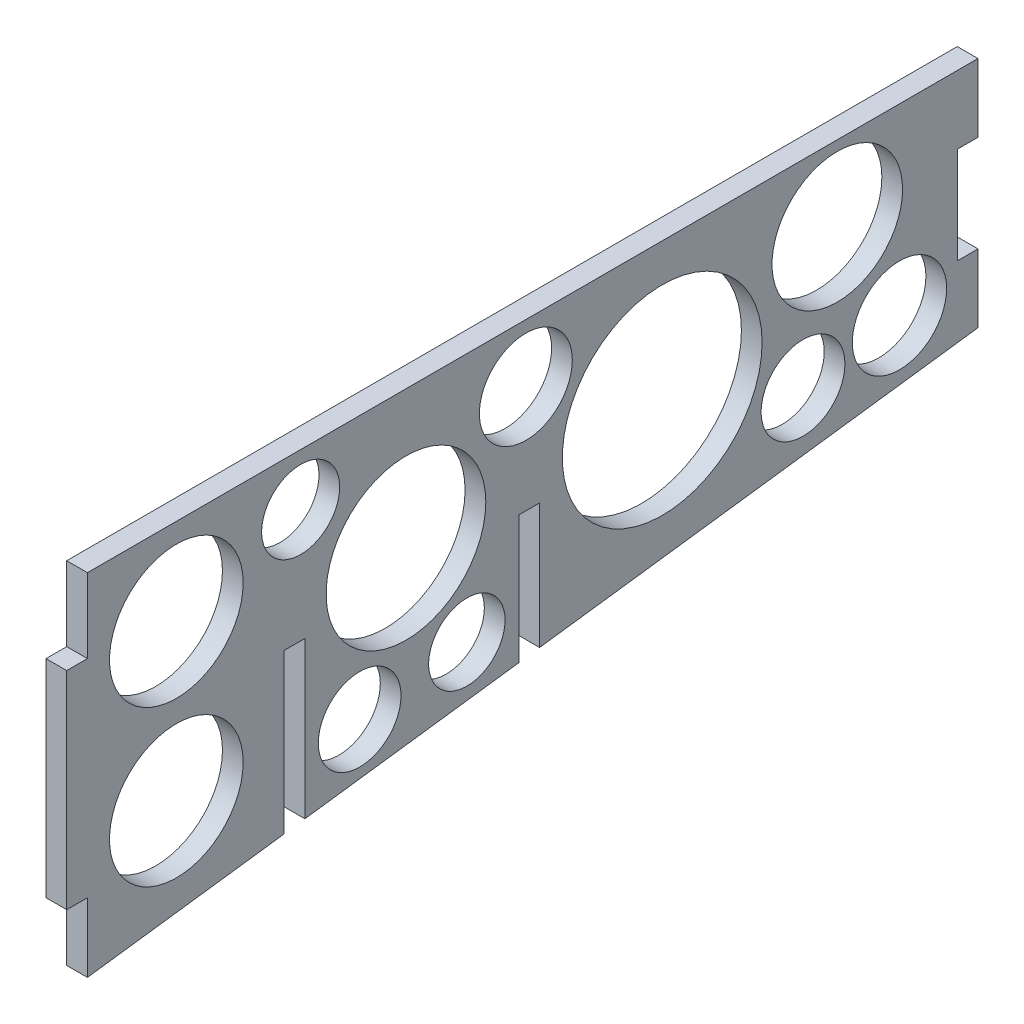
ISO-10303-21;
HEADER;
FILE_DESCRIPTION(('STEP AP214'),'2;1');
FILE_NAME('part.step','',(''),(''),'','','');
FILE_SCHEMA(('AUTOMOTIVE_DESIGN { 1 0 10303 214 1 1 1 1 }'));
ENDSEC;
DATA;
#1=APPLICATION_CONTEXT('core data for automotive mechanical design processes');
#2=APPLICATION_PROTOCOL_DEFINITION('international standard','automotive_design',2000,#1);
#3=PRODUCT_CONTEXT('',#1,'mechanical');
#4=PRODUCT('Part','Part','',(#3));
#5=PRODUCT_RELATED_PRODUCT_CATEGORY('part','',(#4));
#6=PRODUCT_DEFINITION_FORMATION('','',#4);
#7=PRODUCT_DEFINITION_CONTEXT('part definition',#1,'design');
#8=PRODUCT_DEFINITION('design','',#6,#7);
#9=PRODUCT_DEFINITION_SHAPE('','',#8);
#10=(LENGTH_UNIT() NAMED_UNIT(*) SI_UNIT(.MILLI.,.METRE.));
#11=(NAMED_UNIT(*) PLANE_ANGLE_UNIT() SI_UNIT($,.RADIAN.));
#12=(NAMED_UNIT(*) SI_UNIT($,.STERADIAN.) SOLID_ANGLE_UNIT());
#13=UNCERTAINTY_MEASURE_WITH_UNIT(LENGTH_MEASURE(1.E-05),#10,'distance_accuracy_value','');
#14=(GEOMETRIC_REPRESENTATION_CONTEXT(3) GLOBAL_UNCERTAINTY_ASSIGNED_CONTEXT((#13)) GLOBAL_UNIT_ASSIGNED_CONTEXT((#10,
#11,#12)) REPRESENTATION_CONTEXT('',''));
#15=CARTESIAN_POINT('',(0.,0.,0.));
#16=DIRECTION('',(0.,0.,1.));
#17=DIRECTION('',(1.,0.,0.));
#18=AXIS2_PLACEMENT_3D('',#15,#16,#17);
#19=CARTESIAN_POINT('',(3.,-33.7688746807964,-129.));
#20=DIRECTION('',(0.,0.,1.));
#21=DIRECTION('',(1.,0.,0.));
#22=AXIS2_PLACEMENT_3D('',#19,#20,#21);
#23=PLANE('',#22);
#24=DIRECTION('',(0.,1.,0.));
#25=VECTOR('',#24,1.);
#26=CARTESIAN_POINT('',(0.,-33.7688746807964,-129.));
#27=LINE('',#26,#25);
#28=CARTESIAN_POINT('',(0.,-33.7688746807964,-129.));
#29=VERTEX_POINT('',#28);
#30=CARTESIAN_POINT('',(0.,-23.8844373403982,-129.));
#31=VERTEX_POINT('',#30);
#32=EDGE_CURVE('E258',#29,#31,#27,.T.);
#33=ORIENTED_EDGE('',*,*,#32,.T.);
#34=DIRECTION('',(1.,0.,0.));
#35=VECTOR('',#34,1.);
#36=CARTESIAN_POINT('',(-7.,-23.8844373403982,-129.));
#37=LINE('',#36,#35);
#38=CARTESIAN_POINT('',(3.,-23.8844373403982,-129.));
#39=VERTEX_POINT('',#38);
#40=EDGE_CURVE('E299',#31,#39,#37,.T.);
#41=ORIENTED_EDGE('',*,*,#40,.T.);
#42=DIRECTION('',(0.,1.,0.));
#43=VECTOR('',#42,1.);
#44=CARTESIAN_POINT('',(3.,-33.7688746807964,-129.));
#45=LINE('',#44,#43);
#46=CARTESIAN_POINT('',(3.,-33.7688746807964,-129.));
#47=VERTEX_POINT('',#46);
#48=EDGE_CURVE('E234',#47,#39,#45,.T.);
#49=ORIENTED_EDGE('',*,*,#48,.F.);
#50=DIRECTION('',(-1.,0.,0.));
#51=VECTOR('',#50,1.);
#52=CARTESIAN_POINT('',(3.,-33.7688746807964,-129.));
#53=LINE('',#52,#51);
#54=EDGE_CURVE('E263',#47,#29,#53,.T.);
#55=ORIENTED_EDGE('',*,*,#54,.T.);
#56=EDGE_LOOP('',(#33,#41,#49,#55));
#57=FACE_BOUND('',#56,.T.);
#58=ADVANCED_FACE('F73',(#57),#23,.F.);
#59=CARTESIAN_POINT('',(3.,0.,0.));
#60=DIRECTION('',(0.,0.,-1.));
#61=DIRECTION('',(0.,1.,0.));
#62=AXIS2_PLACEMENT_3D('',#59,#60,#61);
#63=PLANE('',#62);
#64=DIRECTION('',(1.,0.,0.));
#65=VECTOR('',#64,1.);
#66=CARTESIAN_POINT('',(0.,-40.7776762914024,0.));
#67=LINE('',#66,#65);
#68=CARTESIAN_POINT('',(0.,-40.7776762914024,0.));
#69=VERTEX_POINT('',#68);
#70=CARTESIAN_POINT('',(3.,-40.7776762914024,0.));
#71=VERTEX_POINT('',#70);
#72=EDGE_CURVE('E388',#69,#71,#67,.T.);
#73=ORIENTED_EDGE('',*,*,#72,.F.);
#74=DIRECTION('',(0.,-1.,0.));
#75=VECTOR('',#74,1.);
#76=CARTESIAN_POINT('',(0.,0.,0.));
#77=LINE('',#76,#75);
#78=CARTESIAN_POINT('',(0.,-50.7776762914024,0.));
#79=VERTEX_POINT('',#78);
#80=EDGE_CURVE('E247',#69,#79,#77,.T.);
#81=ORIENTED_EDGE('',*,*,#80,.T.);
#82=DIRECTION('',(-1.,0.,0.));
#83=VECTOR('',#82,1.);
#84=CARTESIAN_POINT('',(3.,-50.7776762914024,0.));
#85=LINE('',#84,#83);
#86=CARTESIAN_POINT('',(3.,-50.7776762914024,0.));
#87=VERTEX_POINT('',#86);
#88=EDGE_CURVE('E266',#87,#79,#85,.T.);
#89=ORIENTED_EDGE('',*,*,#88,.F.);
#90=DIRECTION('',(0.,-1.,0.));
#91=VECTOR('',#90,1.);
#92=CARTESIAN_POINT('',(3.,0.,0.));
#93=LINE('',#92,#91);
#94=EDGE_CURVE('E430',#71,#87,#93,.T.);
#95=ORIENTED_EDGE('',*,*,#94,.F.);
#96=EDGE_LOOP('',(#73,#81,#89,#95));
#97=FACE_BOUND('',#96,.T.);
#98=ADVANCED_FACE('F440',(#97),#63,.F.);
#99=CARTESIAN_POINT('',(3.,-50.7776762914024,0.));
#100=DIRECTION('',(0.,0.991419352298649,0.130719806791963));
#101=DIRECTION('',(0.,-0.130719806791963,0.991419352298649));
#102=AXIS2_PLACEMENT_3D('',#99,#100,#101);
#103=PLANE('',#102);
#104=DIRECTION('',(0.,0.130719806791963,-0.991419352298649));
#105=VECTOR('',#104,1.);
#106=CARTESIAN_POINT('',(0.,-50.7776762914024,0.));
#107=LINE('',#106,#105);
#108=CARTESIAN_POINT('',(0.,-47.0199177960359,-28.5));
#109=VERTEX_POINT('',#108);
#110=EDGE_CURVE('E253',#79,#109,#107,.T.);
#111=ORIENTED_EDGE('',*,*,#110,.T.);
#112=DIRECTION('',(1.,0.,0.));
#113=VECTOR('',#112,1.);
#114=CARTESIAN_POINT('',(3.,-47.0199177960359,-28.5));
#115=LINE('',#114,#113);
#116=CARTESIAN_POINT('',(3.,-47.0199177960359,-28.5));
#117=VERTEX_POINT('',#116);
#118=EDGE_CURVE('E248',#109,#117,#115,.T.);
#119=ORIENTED_EDGE('',*,*,#118,.T.);
#120=DIRECTION('',(0.,0.130719806791963,-0.991419352298649));
#121=VECTOR('',#120,1.);
#122=CARTESIAN_POINT('',(3.,-50.7776762914024,0.));
#123=LINE('',#122,#121);
#124=EDGE_CURVE('E235',#87,#117,#123,.T.);
#125=ORIENTED_EDGE('',*,*,#124,.F.);
#126=ORIENTED_EDGE('',*,*,#88,.T.);
#127=EDGE_LOOP('',(#111,#119,#125,#126));
#128=FACE_BOUND('',#127,.T.);
#129=ADVANCED_FACE('F444',(#128),#103,.F.);
#130=CARTESIAN_POINT('',(3.,-46.6243642702079,-31.5));
#131=VERTEX_POINT('',#130);
#132=CARTESIAN_POINT('',(3.,-42.5369778366514,-62.5));
#133=VERTEX_POINT('',#132);
#134=EDGE_CURVE('E239',#131,#133,#123,.T.);
#135=ORIENTED_EDGE('',*,*,#134,.F.);
#136=DIRECTION('',(-1.,0.,0.));
#137=VECTOR('',#136,1.);
#138=CARTESIAN_POINT('',(3.,-46.6243642702079,-31.5));
#139=LINE('',#138,#137);
#140=CARTESIAN_POINT('',(0.,-46.6243642702079,-31.5));
#141=VERTEX_POINT('',#140);
#142=EDGE_CURVE('E425',#131,#141,#139,.T.);
#143=ORIENTED_EDGE('',*,*,#142,.T.);
#144=CARTESIAN_POINT('',(0.,-42.5369778366514,-62.5));
#145=VERTEX_POINT('',#144);
#146=EDGE_CURVE('E257',#141,#145,#107,.T.);
#147=ORIENTED_EDGE('',*,*,#146,.T.);
#148=DIRECTION('',(1.,0.,0.));
#149=VECTOR('',#148,1.);
#150=CARTESIAN_POINT('',(3.,-42.5369778366514,-62.5));
#151=LINE('',#150,#149);
#152=EDGE_CURVE('E422',#145,#133,#151,.T.);
#153=ORIENTED_EDGE('',*,*,#152,.T.);
#154=EDGE_LOOP('',(#135,#143,#147,#153));
#155=FACE_BOUND('',#154,.T.);
#156=ADVANCED_FACE('F459',(#155),#103,.F.);
#157=CARTESIAN_POINT('',(3.,0.,0.));
#158=DIRECTION('',(0.,-1.,0.));
#159=DIRECTION('',(0.,0.,-1.));
#160=AXIS2_PLACEMENT_3D('',#157,#158,#159);
#161=PLANE('',#160);
#162=DIRECTION('',(0.,0.,1.));
#163=VECTOR('',#162,1.);
#164=CARTESIAN_POINT('',(0.,0.,0.));
#165=LINE('',#164,#163);
#166=CARTESIAN_POINT('',(0.,0.,-129.));
#167=VERTEX_POINT('',#166);
#168=CARTESIAN_POINT('',(0.,0.,0.));
#169=VERTEX_POINT('',#168);
#170=EDGE_CURVE('E244',#167,#169,#165,.T.);
#171=ORIENTED_EDGE('',*,*,#170,.T.);
#172=DIRECTION('',(-1.,0.,0.));
#173=VECTOR('',#172,1.);
#174=CARTESIAN_POINT('',(3.,0.,0.));
#175=LINE('',#174,#173);
#176=CARTESIAN_POINT('',(3.,0.,0.));
#177=VERTEX_POINT('',#176);
#178=EDGE_CURVE('E269',#177,#169,#175,.T.);
#179=ORIENTED_EDGE('',*,*,#178,.F.);
#180=DIRECTION('',(0.,0.,1.));
#181=VECTOR('',#180,1.);
#182=CARTESIAN_POINT('',(3.,0.,0.));
#183=LINE('',#182,#181);
#184=CARTESIAN_POINT('',(3.,0.,-129.));
#185=VERTEX_POINT('',#184);
#186=EDGE_CURVE('E261',#185,#177,#183,.T.);
#187=ORIENTED_EDGE('',*,*,#186,.F.);
#188=DIRECTION('',(-1.,0.,0.));
#189=VECTOR('',#188,1.);
#190=CARTESIAN_POINT('',(3.,0.,-129.));
#191=LINE('',#190,#189);
#192=EDGE_CURVE('E232',#185,#167,#191,.T.);
#193=ORIENTED_EDGE('',*,*,#192,.T.);
#194=EDGE_LOOP('',(#171,#179,#187,#193));
#195=FACE_BOUND('',#194,.T.);
#196=ADVANCED_FACE('F75',(#195),#161,.F.);
#197=CARTESIAN_POINT('',(0.,-10.7776762914024,0.));
#198=VERTEX_POINT('',#197);
#199=EDGE_CURVE('E249',#169,#198,#77,.T.);
#200=ORIENTED_EDGE('',*,*,#199,.T.);
#201=DIRECTION('',(1.,0.,0.));
#202=VECTOR('',#201,1.);
#203=CARTESIAN_POINT('',(0.,-10.7776762914024,0.));
#204=LINE('',#203,#202);
#205=CARTESIAN_POINT('',(3.,-10.7776762914024,0.));
#206=VERTEX_POINT('',#205);
#207=EDGE_CURVE('E381',#198,#206,#204,.T.);
#208=ORIENTED_EDGE('',*,*,#207,.T.);
#209=EDGE_CURVE('E431',#177,#206,#93,.T.);
#210=ORIENTED_EDGE('',*,*,#209,.F.);
#211=ORIENTED_EDGE('',*,*,#178,.T.);
#212=EDGE_LOOP('',(#200,#208,#210,#211));
#213=FACE_BOUND('',#212,.T.);
#214=ADVANCED_FACE('F497',(#213),#63,.F.);
#215=CARTESIAN_POINT('',(3.,-42.1414243108234,-65.5));
#216=VERTEX_POINT('',#215);
#217=EDGE_CURVE('E241',#216,#47,#123,.T.);
#218=ORIENTED_EDGE('',*,*,#217,.F.);
#219=DIRECTION('',(-1.,0.,0.));
#220=VECTOR('',#219,1.);
#221=CARTESIAN_POINT('',(3.,-42.1414243108234,-65.5));
#222=LINE('',#221,#220);
#223=CARTESIAN_POINT('',(0.,-42.1414243108234,-65.5));
#224=VERTEX_POINT('',#223);
#225=EDGE_CURVE('E408',#216,#224,#222,.T.);
#226=ORIENTED_EDGE('',*,*,#225,.T.);
#227=EDGE_CURVE('E252',#224,#29,#107,.T.);
#228=ORIENTED_EDGE('',*,*,#227,.T.);
#229=ORIENTED_EDGE('',*,*,#54,.F.);
#230=EDGE_LOOP('',(#218,#226,#228,#229));
#231=FACE_BOUND('',#230,.T.);
#232=ADVANCED_FACE('F474',(#231),#103,.F.);
#233=CARTESIAN_POINT('',(3.,-9.8844373403982,-129.));
#234=VERTEX_POINT('',#233);
#235=EDGE_CURVE('E225',#234,#185,#45,.T.);
#236=ORIENTED_EDGE('',*,*,#235,.F.);
#237=DIRECTION('',(1.,0.,0.));
#238=VECTOR('',#237,1.);
#239=CARTESIAN_POINT('',(-7.,-9.8844373403982,-129.));
#240=LINE('',#239,#238);
#241=CARTESIAN_POINT('',(0.,-9.8844373403982,-129.));
#242=VERTEX_POINT('',#241);
#243=EDGE_CURVE('E208',#242,#234,#240,.T.);
#244=ORIENTED_EDGE('',*,*,#243,.F.);
#245=EDGE_CURVE('E256',#242,#167,#27,.T.);
#246=ORIENTED_EDGE('',*,*,#245,.T.);
#247=ORIENTED_EDGE('',*,*,#192,.F.);
#248=EDGE_LOOP('',(#236,#244,#246,#247));
#249=FACE_BOUND('',#248,.T.);
#250=ADVANCED_FACE('F230',(#249),#23,.F.);
#251=CARTESIAN_POINT('',(3.,0.,0.));
#252=DIRECTION('',(1.,0.,0.));
#253=DIRECTION('',(0.,0.,-1.));
#254=AXIS2_PLACEMENT_3D('',#251,#252,#253);
#255=PLANE('',#254);
#256=DIRECTION('',(0.,0.,-1.));
#257=VECTOR('',#256,1.);
#258=CARTESIAN_POINT('',(3.,-23.8844373403982,-129.));
#259=LINE('',#258,#257);
#260=CARTESIAN_POINT('',(3.,-23.8844373403982,-126.));
#261=VERTEX_POINT('',#260);
#262=EDGE_CURVE('E218',#261,#39,#259,.T.);
#263=ORIENTED_EDGE('',*,*,#262,.F.);
#264=DIRECTION('',(0.,-1.,0.));
#265=VECTOR('',#264,1.);
#266=CARTESIAN_POINT('',(3.,-9.88443734039819,-126.));
#267=LINE('',#266,#265);
#268=CARTESIAN_POINT('',(3.,-9.88443734039819,-126.));
#269=VERTEX_POINT('',#268);
#270=EDGE_CURVE('E228',#269,#261,#267,.T.);
#271=ORIENTED_EDGE('',*,*,#270,.F.);
#272=DIRECTION('',(0.,0.,1.));
#273=VECTOR('',#272,1.);
#274=CARTESIAN_POINT('',(3.,-9.8844373403982,-129.));
#275=LINE('',#274,#273);
#276=EDGE_CURVE('E211',#234,#269,#275,.T.);
#277=ORIENTED_EDGE('',*,*,#276,.F.);
#278=ORIENTED_EDGE('',*,*,#235,.T.);
#279=ORIENTED_EDGE('',*,*,#186,.T.);
#280=ORIENTED_EDGE('',*,*,#209,.T.);
#281=DIRECTION('',(0.,0.,1.));
#282=VECTOR('',#281,1.);
#283=CARTESIAN_POINT('',(3.,-10.7776762914024,0.));
#284=LINE('',#283,#282);
#285=CARTESIAN_POINT('',(3.,-10.7776762914024,3.));
#286=VERTEX_POINT('',#285);
#287=EDGE_CURVE('E96',#206,#286,#284,.T.);
#288=ORIENTED_EDGE('',*,*,#287,.T.);
#289=DIRECTION('',(0.,-1.,0.));
#290=VECTOR('',#289,1.);
#291=CARTESIAN_POINT('',(3.,-10.7776762914024,3.));
#292=LINE('',#291,#290);
#293=CARTESIAN_POINT('',(3.,-40.7776762914024,3.));
#294=VERTEX_POINT('',#293);
#295=EDGE_CURVE('E383',#286,#294,#292,.T.);
#296=ORIENTED_EDGE('',*,*,#295,.T.);
#297=DIRECTION('',(0.,0.,-1.));
#298=VECTOR('',#297,1.);
#299=CARTESIAN_POINT('',(3.,-40.7776762914024,0.));
#300=LINE('',#299,#298);
#301=EDGE_CURVE('E376',#294,#71,#300,.T.);
#302=ORIENTED_EDGE('',*,*,#301,.T.);
#303=ORIENTED_EDGE('',*,*,#94,.T.);
#304=ORIENTED_EDGE('',*,*,#124,.T.);
#305=DIRECTION('',(0.,-1.,0.));
#306=VECTOR('',#305,1.);
#307=CARTESIAN_POINT('',(3.,-24.,-28.5));
#308=LINE('',#307,#306);
#309=CARTESIAN_POINT('',(3.,-24.,-28.5));
#310=VERTEX_POINT('',#309);
#311=EDGE_CURVE('E396',#310,#117,#308,.T.);
#312=ORIENTED_EDGE('',*,*,#311,.F.);
#313=DIRECTION('',(0.,0.,1.));
#314=VECTOR('',#313,1.);
#315=CARTESIAN_POINT('',(3.,-24.,-28.5));
#316=LINE('',#315,#314);
#317=CARTESIAN_POINT('',(3.,-24.,-31.5));
#318=VERTEX_POINT('',#317);
#319=EDGE_CURVE('E402',#318,#310,#316,.T.);
#320=ORIENTED_EDGE('',*,*,#319,.F.);
#321=DIRECTION('',(0.,1.,0.));
#322=VECTOR('',#321,1.);
#323=CARTESIAN_POINT('',(3.,-24.,-31.5));
#324=LINE('',#323,#322);
#325=EDGE_CURVE('E398',#131,#318,#324,.T.);
#326=ORIENTED_EDGE('',*,*,#325,.F.);
#327=ORIENTED_EDGE('',*,*,#134,.T.);
#328=DIRECTION('',(0.,-1.,0.));
#329=VECTOR('',#328,1.);
#330=CARTESIAN_POINT('',(3.,-24.,-62.5));
#331=LINE('',#330,#329);
#332=CARTESIAN_POINT('',(3.,-24.,-62.5));
#333=VERTEX_POINT('',#332);
#334=EDGE_CURVE('E399',#333,#133,#331,.T.);
#335=ORIENTED_EDGE('',*,*,#334,.F.);
#336=DIRECTION('',(0.,0.,1.));
#337=VECTOR('',#336,1.);
#338=CARTESIAN_POINT('',(3.,-24.,-62.5));
#339=LINE('',#338,#337);
#340=CARTESIAN_POINT('',(3.,-24.,-65.5));
#341=VERTEX_POINT('',#340);
#342=EDGE_CURVE('E412',#341,#333,#339,.T.);
#343=ORIENTED_EDGE('',*,*,#342,.F.);
#344=DIRECTION('',(0.,1.,0.));
#345=VECTOR('',#344,1.);
#346=CARTESIAN_POINT('',(3.,-24.,-65.5));
#347=LINE('',#346,#345);
#348=EDGE_CURVE('E416',#216,#341,#347,.T.);
#349=ORIENTED_EDGE('',*,*,#348,.F.);
#350=ORIENTED_EDGE('',*,*,#217,.T.);
#351=ORIENTED_EDGE('',*,*,#48,.T.);
#352=EDGE_LOOP('',(#263,#271,#277,#278,#279,#280,#288,#296,#302,#303,#304,#312,#320,#326,#327,
#335,#343,#349,#350,#351));
#353=FACE_BOUND('',#352,.T.);
#354=CARTESIAN_POINT('',(3.,-36.1848644798585,-54.9604059213721));
#355=DIRECTION('',(1.,0.,0.));
#356=DIRECTION('',(0.,0.,-1.));
#357=AXIS2_PLACEMENT_3D('',#354,#355,#356);
#358=CIRCLE('',#357,5.53197328416543);
#359=CARTESIAN_POINT('',(3.,-36.1848644798585,-60.4923792055375));
#360=VERTEX_POINT('',#359);
#361=EDGE_CURVE('E338',#360,#360,#358,.T.);
#362=ORIENTED_EDGE('',*,*,#361,.F.);
#363=EDGE_LOOP('',(#362));
#364=FACE_BOUND('',#363,.T.);
#365=CARTESIAN_POINT('',(3.,-38.1143670587292,-39.4325042152225));
#366=DIRECTION('',(1.,0.,0.));
#367=DIRECTION('',(0.,0.,-1.));
#368=AXIS2_PLACEMENT_3D('',#365,#366,#367);
#369=CIRCLE('',#368,5.98991326334209);
#370=CARTESIAN_POINT('',(3.,-38.1143670587292,-45.4224174785646));
#371=VERTEX_POINT('',#370);
#372=EDGE_CURVE('E332',#371,#371,#369,.T.);
#373=ORIENTED_EDGE('',*,*,#372,.F.);
#374=EDGE_LOOP('',(#373));
#375=FACE_BOUND('',#374,.T.);
#376=CARTESIAN_POINT('',(3.,-8.43677977419463,-63.5053459135136));
#377=DIRECTION('',(1.,0.,0.));
#378=DIRECTION('',(0.,0.,-1.));
#379=AXIS2_PLACEMENT_3D('',#376,#377,#378);
#380=CIRCLE('',#379,6.72930872562468);
#381=CARTESIAN_POINT('',(3.,-8.43677977419463,-70.2346546391383));
#382=VERTEX_POINT('',#381);
#383=EDGE_CURVE('E326',#382,#382,#380,.T.);
#384=ORIENTED_EDGE('',*,*,#383,.F.);
#385=EDGE_LOOP('',(#384));
#386=FACE_BOUND('',#385,.T.);
#387=CARTESIAN_POINT('',(3.,-7.51796902235145,-30.8875642230809));
#388=DIRECTION('',(1.,0.,0.));
#389=DIRECTION('',(0.,0.,-1.));
#390=AXIS2_PLACEMENT_3D('',#387,#388,#389);
#391=CIRCLE('',#390,5.65274000225061);
#392=CARTESIAN_POINT('',(3.,-7.51796902235145,-36.5403042253315));
#393=VERTEX_POINT('',#392);
#394=EDGE_CURVE('E319',#393,#393,#391,.T.);
#395=ORIENTED_EDGE('',*,*,#394,.F.);
#396=EDGE_LOOP('',(#395));
#397=FACE_BOUND('',#396,.T.);
#398=CARTESIAN_POINT('',(3.,-19.9844737825548,-46.1398227036776));
#399=DIRECTION('',(1.,0.,0.));
#400=DIRECTION('',(0.,0.,-1.));
#401=AXIS2_PLACEMENT_3D('',#398,#399,#400);
#402=CIRCLE('',#401,11.5646121759465);
#403=CARTESIAN_POINT('',(3.,-19.9844737825548,-57.7044348796241));
#404=VERTEX_POINT('',#403);
#405=EDGE_CURVE('E355',#404,#404,#402,.T.);
#406=ORIENTED_EDGE('',*,*,#405,.F.);
#407=EDGE_LOOP('',(#406));
#408=FACE_BOUND('',#407,.T.);
#409=CARTESIAN_POINT('',(3.,-12.5421066926251,-12.8788734869547));
#410=DIRECTION('',(1.,0.,0.));
#411=DIRECTION('',(0.,0.,-1.));
#412=AXIS2_PLACEMENT_3D('',#409,#410,#411);
#413=CIRCLE('',#412,9.67896371256032);
#414=CARTESIAN_POINT('',(3.,-12.5421066926251,-22.5578371995151));
#415=VERTEX_POINT('',#414);
#416=EDGE_CURVE('E362',#415,#415,#413,.T.);
#417=ORIENTED_EDGE('',*,*,#416,.F.);
#418=EDGE_LOOP('',(#417));
#419=FACE_BOUND('',#418,.T.);
#420=CARTESIAN_POINT('',(3.,-35.0529701127829,-12.8788734869547));
#421=DIRECTION('',(1.,0.,0.));
#422=DIRECTION('',(0.,0.,-1.));
#423=AXIS2_PLACEMENT_3D('',#420,#421,#422);
#424=CIRCLE('',#423,9.67896371256032);
#425=CARTESIAN_POINT('',(3.,-35.0529701127829,-22.5578371995151));
#426=VERTEX_POINT('',#425);
#427=EDGE_CURVE('E343',#426,#426,#424,.T.);
#428=ORIENTED_EDGE('',*,*,#427,.F.);
#429=EDGE_LOOP('',(#428));
#430=FACE_BOUND('',#429,.T.);
#431=CARTESIAN_POINT('',(3.,-10.9175688041712,-108.618953829013));
#432=DIRECTION('',(1.,0.,0.));
#433=DIRECTION('',(0.,0.,-1.));
#434=AXIS2_PLACEMENT_3D('',#431,#432,#433);
#435=CIRCLE('',#434,9.45507824005018);
#436=CARTESIAN_POINT('',(3.,-10.9175688041712,-118.074032069064));
#437=VERTEX_POINT('',#436);
#438=EDGE_CURVE('E350',#437,#437,#435,.T.);
#439=ORIENTED_EDGE('',*,*,#438,.F.);
#440=EDGE_LOOP('',(#439));
#441=FACE_BOUND('',#440,.T.);
#442=CARTESIAN_POINT('',(3.,-28.6506163147445,-103.65737576906));
#443=DIRECTION('',(1.,0.,0.));
#444=DIRECTION('',(0.,0.,-1.));
#445=AXIS2_PLACEMENT_3D('',#442,#443,#444);
#446=CIRCLE('',#445,6.06693459828225);
#447=CARTESIAN_POINT('',(3.,-28.6506163147445,-109.724310367343));
#448=VERTEX_POINT('',#447);
#449=EDGE_CURVE('E307',#448,#448,#446,.T.);
#450=ORIENTED_EDGE('',*,*,#449,.F.);
#451=EDGE_LOOP('',(#450));
#452=FACE_BOUND('',#451,.T.);
#453=CARTESIAN_POINT('',(3.,-26.5373515855052,-117.623299197077));
#454=DIRECTION('',(1.,0.,0.));
#455=DIRECTION('',(0.,0.,-1.));
#456=AXIS2_PLACEMENT_3D('',#453,#454,#455);
#457=CIRCLE('',#456,6.82955190133803);
#458=CARTESIAN_POINT('',(3.,-26.5373515855052,-124.452851098415));
#459=VERTEX_POINT('',#458);
#460=EDGE_CURVE('E314',#459,#459,#457,.T.);
#461=ORIENTED_EDGE('',*,*,#460,.F.);
#462=EDGE_LOOP('',(#461));
#463=FACE_BOUND('',#462,.T.);
#464=CARTESIAN_POINT('',(3.,-19.9844737825548,-83.2597770781419));
#465=DIRECTION('',(1.,0.,0.));
#466=DIRECTION('',(0.,0.,-1.));
#467=AXIS2_PLACEMENT_3D('',#464,#465,#466);
#468=CIRCLE('',#467,14.4708029022713);
#469=CARTESIAN_POINT('',(3.,-19.9844737825548,-97.7305799804132));
#470=VERTEX_POINT('',#469);
#471=EDGE_CURVE('E358',#470,#470,#468,.T.);
#472=ORIENTED_EDGE('',*,*,#471,.F.);
#473=EDGE_LOOP('',(#472));
#474=FACE_BOUND('',#473,.T.);
#475=ADVANCED_FACE('F222',(#353,#364,#375,#386,#397,#408,#419,#430,#441,#452,#463,#474),#255,.T.);
#476=CARTESIAN_POINT('',(0.,0.,0.));
#477=DIRECTION('',(1.,0.,0.));
#478=DIRECTION('',(0.,0.,-1.));
#479=AXIS2_PLACEMENT_3D('',#476,#477,#478);
#480=PLANE('',#479);
#481=CARTESIAN_POINT('',(0.,-36.1848644798585,-54.9604059213721));
#482=DIRECTION('',(1.,0.,0.));
#483=DIRECTION('',(0.,0.,-1.));
#484=AXIS2_PLACEMENT_3D('',#481,#482,#483);
#485=CIRCLE('',#484,5.53197328416543);
#486=CARTESIAN_POINT('',(0.,-36.1848644798585,-60.4923792055375));
#487=VERTEX_POINT('',#486);
#488=EDGE_CURVE('E310',#487,#487,#485,.T.);
#489=ORIENTED_EDGE('',*,*,#488,.T.);
#490=EDGE_LOOP('',(#489));
#491=FACE_BOUND('',#490,.T.);
#492=CARTESIAN_POINT('',(0.,-38.1143670587292,-39.4325042152225));
#493=DIRECTION('',(1.,0.,0.));
#494=DIRECTION('',(0.,0.,-1.));
#495=AXIS2_PLACEMENT_3D('',#492,#493,#494);
#496=CIRCLE('',#495,5.98991326334209);
#497=CARTESIAN_POINT('',(0.,-38.1143670587292,-45.4224174785646));
#498=VERTEX_POINT('',#497);
#499=EDGE_CURVE('E335',#498,#498,#496,.T.);
#500=ORIENTED_EDGE('',*,*,#499,.T.);
#501=EDGE_LOOP('',(#500));
#502=FACE_BOUND('',#501,.T.);
#503=CARTESIAN_POINT('',(0.,-8.43677977419463,-63.5053459135136));
#504=DIRECTION('',(1.,0.,0.));
#505=DIRECTION('',(0.,0.,-1.));
#506=AXIS2_PLACEMENT_3D('',#503,#504,#505);
#507=CIRCLE('',#506,6.72930872562468);
#508=CARTESIAN_POINT('',(0.,-8.43677977419463,-70.2346546391383));
#509=VERTEX_POINT('',#508);
#510=EDGE_CURVE('E329',#509,#509,#507,.T.);
#511=ORIENTED_EDGE('',*,*,#510,.T.);
#512=EDGE_LOOP('',(#511));
#513=FACE_BOUND('',#512,.T.);
#514=CARTESIAN_POINT('',(0.,-7.51796902235145,-30.8875642230809));
#515=DIRECTION('',(1.,0.,0.));
#516=DIRECTION('',(0.,0.,-1.));
#517=AXIS2_PLACEMENT_3D('',#514,#515,#516);
#518=CIRCLE('',#517,5.65274000225061);
#519=CARTESIAN_POINT('',(0.,-7.51796902235145,-36.5403042253315));
#520=VERTEX_POINT('',#519);
#521=EDGE_CURVE('E323',#520,#520,#518,.T.);
#522=ORIENTED_EDGE('',*,*,#521,.T.);
#523=EDGE_LOOP('',(#522));
#524=FACE_BOUND('',#523,.T.);
#525=CARTESIAN_POINT('',(0.,-19.9844737825548,-46.1398227036776));
#526=DIRECTION('',(1.,0.,0.));
#527=DIRECTION('',(0.,0.,-1.));
#528=AXIS2_PLACEMENT_3D('',#525,#526,#527);
#529=CIRCLE('',#528,11.5646121759465);
#530=CARTESIAN_POINT('',(0.,-19.9844737825548,-57.7044348796241));
#531=VERTEX_POINT('',#530);
#532=EDGE_CURVE('E359',#531,#531,#529,.T.);
#533=ORIENTED_EDGE('',*,*,#532,.T.);
#534=EDGE_LOOP('',(#533));
#535=FACE_BOUND('',#534,.T.);
#536=CARTESIAN_POINT('',(0.,-12.5421066926251,-12.8788734869547));
#537=DIRECTION('',(1.,0.,0.));
#538=DIRECTION('',(0.,0.,-1.));
#539=AXIS2_PLACEMENT_3D('',#536,#537,#538);
#540=CIRCLE('',#539,9.67896371256032);
#541=CARTESIAN_POINT('',(0.,-12.5421066926251,-22.5578371995151));
#542=VERTEX_POINT('',#541);
#543=EDGE_CURVE('E346',#542,#542,#540,.T.);
#544=ORIENTED_EDGE('',*,*,#543,.T.);
#545=EDGE_LOOP('',(#544));
#546=FACE_BOUND('',#545,.T.);
#547=CARTESIAN_POINT('',(0.,-35.0529701127829,-12.8788734869547));
#548=DIRECTION('',(1.,0.,0.));
#549=DIRECTION('',(0.,0.,-1.));
#550=AXIS2_PLACEMENT_3D('',#547,#548,#549);
#551=CIRCLE('',#550,9.67896371256032);
#552=CARTESIAN_POINT('',(0.,-35.0529701127829,-22.5578371995151));
#553=VERTEX_POINT('',#552);
#554=EDGE_CURVE('E347',#553,#553,#551,.T.);
#555=ORIENTED_EDGE('',*,*,#554,.T.);
#556=EDGE_LOOP('',(#555));
#557=FACE_BOUND('',#556,.T.);
#558=CARTESIAN_POINT('',(0.,-10.9175688041712,-108.618953829013));
#559=DIRECTION('',(1.,0.,0.));
#560=DIRECTION('',(0.,0.,-1.));
#561=AXIS2_PLACEMENT_3D('',#558,#559,#560);
#562=CIRCLE('',#561,9.45507824005018);
#563=CARTESIAN_POINT('',(0.,-10.9175688041712,-118.074032069064));
#564=VERTEX_POINT('',#563);
#565=EDGE_CURVE('E322',#564,#564,#562,.T.);
#566=ORIENTED_EDGE('',*,*,#565,.T.);
#567=EDGE_LOOP('',(#566));
#568=FACE_BOUND('',#567,.T.);
#569=CARTESIAN_POINT('',(0.,-28.6506163147445,-103.65737576906));
#570=DIRECTION('',(1.,0.,0.));
#571=DIRECTION('',(0.,0.,-1.));
#572=AXIS2_PLACEMENT_3D('',#569,#570,#571);
#573=CIRCLE('',#572,6.06693459828225);
#574=CARTESIAN_POINT('',(0.,-28.6506163147445,-109.724310367343));
#575=VERTEX_POINT('',#574);
#576=EDGE_CURVE('E311',#575,#575,#573,.T.);
#577=ORIENTED_EDGE('',*,*,#576,.T.);
#578=EDGE_LOOP('',(#577));
#579=FACE_BOUND('',#578,.T.);
#580=CARTESIAN_POINT('',(0.,-26.5373515855052,-117.623299197077));
#581=DIRECTION('',(1.,0.,0.));
#582=DIRECTION('',(0.,0.,-1.));
#583=AXIS2_PLACEMENT_3D('',#580,#581,#582);
#584=CIRCLE('',#583,6.82955190133803);
#585=CARTESIAN_POINT('',(0.,-26.5373515855052,-124.452851098415));
#586=VERTEX_POINT('',#585);
#587=EDGE_CURVE('E302',#586,#586,#584,.T.);
#588=ORIENTED_EDGE('',*,*,#587,.T.);
#589=EDGE_LOOP('',(#588));
#590=FACE_BOUND('',#589,.T.);
#591=CARTESIAN_POINT('',(0.,-19.9844737825548,-83.2597770781419));
#592=DIRECTION('',(1.,0.,0.));
#593=DIRECTION('',(0.,0.,-1.));
#594=AXIS2_PLACEMENT_3D('',#591,#592,#593);
#595=CIRCLE('',#594,14.4708029022713);
#596=CARTESIAN_POINT('',(0.,-19.9844737825548,-97.7305799804132));
#597=VERTEX_POINT('',#596);
#598=EDGE_CURVE('E367',#597,#597,#595,.T.);
#599=ORIENTED_EDGE('',*,*,#598,.T.);
#600=EDGE_LOOP('',(#599));
#601=FACE_BOUND('',#600,.T.);
#602=DIRECTION('',(0.,-1.,0.));
#603=VECTOR('',#602,1.);
#604=CARTESIAN_POINT('',(0.,0.,-126.));
#605=LINE('',#604,#603);
#606=CARTESIAN_POINT('',(0.,-9.88443734039819,-126.));
#607=VERTEX_POINT('',#606);
#608=CARTESIAN_POINT('',(0.,-23.8844373403982,-126.));
#609=VERTEX_POINT('',#608);
#610=EDGE_CURVE('E81',#607,#609,#605,.T.);
#611=ORIENTED_EDGE('',*,*,#610,.T.);
#612=DIRECTION('',(0.,0.,-1.));
#613=VECTOR('',#612,1.);
#614=CARTESIAN_POINT('',(0.,-23.8844373403983,0.));
#615=LINE('',#614,#613);
#616=EDGE_CURVE('E12',#609,#31,#615,.T.);
#617=ORIENTED_EDGE('',*,*,#616,.T.);
#618=ORIENTED_EDGE('',*,*,#32,.F.);
#619=ORIENTED_EDGE('',*,*,#227,.F.);
#620=DIRECTION('',(0.,1.,0.));
#621=VECTOR('',#620,1.);
#622=CARTESIAN_POINT('',(0.,0.,-65.5));
#623=LINE('',#622,#621);
#624=CARTESIAN_POINT('',(0.,-24.,-65.5));
#625=VERTEX_POINT('',#624);
#626=EDGE_CURVE('E272',#224,#625,#623,.T.);
#627=ORIENTED_EDGE('',*,*,#626,.T.);
#628=DIRECTION('',(0.,0.,1.));
#629=VECTOR('',#628,1.);
#630=CARTESIAN_POINT('',(0.,-24.,0.));
#631=LINE('',#630,#629);
#632=CARTESIAN_POINT('',(0.,-24.,-62.5));
#633=VERTEX_POINT('',#632);
#634=EDGE_CURVE('E275',#625,#633,#631,.T.);
#635=ORIENTED_EDGE('',*,*,#634,.T.);
#636=DIRECTION('',(0.,-1.,0.));
#637=VECTOR('',#636,1.);
#638=CARTESIAN_POINT('',(0.,0.,-62.5));
#639=LINE('',#638,#637);
#640=EDGE_CURVE('E278',#633,#145,#639,.T.);
#641=ORIENTED_EDGE('',*,*,#640,.T.);
#642=ORIENTED_EDGE('',*,*,#146,.F.);
#643=DIRECTION('',(0.,1.,0.));
#644=VECTOR('',#643,1.);
#645=CARTESIAN_POINT('',(0.,0.,-31.5));
#646=LINE('',#645,#644);
#647=CARTESIAN_POINT('',(0.,-24.,-31.5));
#648=VERTEX_POINT('',#647);
#649=EDGE_CURVE('E281',#141,#648,#646,.T.);
#650=ORIENTED_EDGE('',*,*,#649,.T.);
#651=DIRECTION('',(0.,0.,1.));
#652=VECTOR('',#651,1.);
#653=CARTESIAN_POINT('',(0.,-24.,0.));
#654=LINE('',#653,#652);
#655=CARTESIAN_POINT('',(0.,-24.,-28.5));
#656=VERTEX_POINT('',#655);
#657=EDGE_CURVE('E284',#648,#656,#654,.T.);
#658=ORIENTED_EDGE('',*,*,#657,.T.);
#659=DIRECTION('',(0.,-1.,0.));
#660=VECTOR('',#659,1.);
#661=CARTESIAN_POINT('',(0.,0.,-28.5));
#662=LINE('',#661,#660);
#663=EDGE_CURVE('E287',#656,#109,#662,.T.);
#664=ORIENTED_EDGE('',*,*,#663,.T.);
#665=ORIENTED_EDGE('',*,*,#110,.F.);
#666=ORIENTED_EDGE('',*,*,#80,.F.);
#667=DIRECTION('',(0.,0.,-1.));
#668=VECTOR('',#667,1.);
#669=CARTESIAN_POINT('',(0.,-40.7776762914024,0.));
#670=LINE('',#669,#668);
#671=CARTESIAN_POINT('',(0.,-40.7776762914024,3.));
#672=VERTEX_POINT('',#671);
#673=EDGE_CURVE('E379',#672,#69,#670,.T.);
#674=ORIENTED_EDGE('',*,*,#673,.F.);
#675=DIRECTION('',(0.,-1.,0.));
#676=VECTOR('',#675,1.);
#677=CARTESIAN_POINT('',(0.,-10.7776762914024,3.));
#678=LINE('',#677,#676);
#679=CARTESIAN_POINT('',(0.,-10.7776762914024,3.));
#680=VERTEX_POINT('',#679);
#681=EDGE_CURVE('E375',#680,#672,#678,.T.);
#682=ORIENTED_EDGE('',*,*,#681,.F.);
#683=DIRECTION('',(0.,0.,1.));
#684=VECTOR('',#683,1.);
#685=CARTESIAN_POINT('',(0.,-10.7776762914024,0.));
#686=LINE('',#685,#684);
#687=EDGE_CURVE('E372',#198,#680,#686,.T.);
#688=ORIENTED_EDGE('',*,*,#687,.F.);
#689=ORIENTED_EDGE('',*,*,#199,.F.);
#690=ORIENTED_EDGE('',*,*,#170,.F.);
#691=ORIENTED_EDGE('',*,*,#245,.F.);
#692=DIRECTION('',(0.,0.,1.));
#693=VECTOR('',#692,1.);
#694=CARTESIAN_POINT('',(0.,-9.88443734039805,0.));
#695=LINE('',#694,#693);
#696=EDGE_CURVE('E214',#242,#607,#695,.T.);
#697=ORIENTED_EDGE('',*,*,#696,.T.);
#698=EDGE_LOOP('',(#611,#617,#618,#619,#627,#635,#641,#642,#650,#658,#664,#665,#666,#674,#682,
#688,#689,#690,#691,#697));
#699=FACE_BOUND('',#698,.T.);
#700=ADVANCED_FACE('F292',(#491,#502,#513,#524,#535,#546,#557,#568,#579,#590,#601,#699),#480,.F.);
#701=CARTESIAN_POINT('',(-17.,-24.,-62.5));
#702=DIRECTION('',(0.,0.,1.));
#703=DIRECTION('',(1.,0.,0.));
#704=AXIS2_PLACEMENT_3D('',#701,#702,#703);
#705=PLANE('',#704);
#706=ORIENTED_EDGE('',*,*,#640,.F.);
#707=DIRECTION('',(1.,0.,0.));
#708=VECTOR('',#707,1.);
#709=CARTESIAN_POINT('',(-17.,-24.,-62.5));
#710=LINE('',#709,#708);
#711=EDGE_CURVE('E390',#633,#333,#710,.T.);
#712=ORIENTED_EDGE('',*,*,#711,.T.);
#713=ORIENTED_EDGE('',*,*,#334,.T.);
#714=ORIENTED_EDGE('',*,*,#152,.F.);
#715=EDGE_LOOP('',(#706,#712,#713,#714));
#716=FACE_BOUND('',#715,.T.);
#717=ADVANCED_FACE('F462',(#716),#705,.F.);
#718=CARTESIAN_POINT('',(-17.,-24.,-62.5));
#719=DIRECTION('',(0.,1.,0.));
#720=DIRECTION('',(0.,0.,1.));
#721=AXIS2_PLACEMENT_3D('',#718,#719,#720);
#722=PLANE('',#721);
#723=DIRECTION('',(1.,0.,0.));
#724=VECTOR('',#723,1.);
#725=CARTESIAN_POINT('',(-17.,-24.,-65.5));
#726=LINE('',#725,#724);
#727=EDGE_CURVE('E410',#625,#341,#726,.T.);
#728=ORIENTED_EDGE('',*,*,#727,.T.);
#729=ORIENTED_EDGE('',*,*,#342,.T.);
#730=ORIENTED_EDGE('',*,*,#711,.F.);
#731=ORIENTED_EDGE('',*,*,#634,.F.);
#732=EDGE_LOOP('',(#728,#729,#730,#731));
#733=FACE_BOUND('',#732,.T.);
#734=ADVANCED_FACE('F467',(#733),#722,.F.);
#735=CARTESIAN_POINT('',(-17.,-24.,-65.5));
#736=DIRECTION('',(0.,0.,-1.));
#737=DIRECTION('',(0.,1.,0.));
#738=AXIS2_PLACEMENT_3D('',#735,#736,#737);
#739=PLANE('',#738);
#740=ORIENTED_EDGE('',*,*,#348,.T.);
#741=ORIENTED_EDGE('',*,*,#727,.F.);
#742=ORIENTED_EDGE('',*,*,#626,.F.);
#743=ORIENTED_EDGE('',*,*,#225,.F.);
#744=EDGE_LOOP('',(#740,#741,#742,#743));
#745=FACE_BOUND('',#744,.T.);
#746=ADVANCED_FACE('F550',(#745),#739,.F.);
#747=CARTESIAN_POINT('',(-17.,-24.,-28.5));
#748=DIRECTION('',(0.,0.,1.));
#749=DIRECTION('',(1.,0.,0.));
#750=AXIS2_PLACEMENT_3D('',#747,#748,#749);
#751=PLANE('',#750);
#752=ORIENTED_EDGE('',*,*,#663,.F.);
#753=DIRECTION('',(1.,0.,0.));
#754=VECTOR('',#753,1.);
#755=CARTESIAN_POINT('',(-17.,-24.,-28.5));
#756=LINE('',#755,#754);
#757=EDGE_CURVE('E406',#656,#310,#756,.T.);
#758=ORIENTED_EDGE('',*,*,#757,.T.);
#759=ORIENTED_EDGE('',*,*,#311,.T.);
#760=ORIENTED_EDGE('',*,*,#118,.F.);
#761=EDGE_LOOP('',(#752,#758,#759,#760));
#762=FACE_BOUND('',#761,.T.);
#763=ADVANCED_FACE('F446',(#762),#751,.F.);
#764=CARTESIAN_POINT('',(-17.,-24.,-28.5));
#765=DIRECTION('',(0.,1.,0.));
#766=DIRECTION('',(0.,0.,1.));
#767=AXIS2_PLACEMENT_3D('',#764,#765,#766);
#768=PLANE('',#767);
#769=DIRECTION('',(1.,0.,0.));
#770=VECTOR('',#769,1.);
#771=CARTESIAN_POINT('',(-17.,-24.,-31.5));
#772=LINE('',#771,#770);
#773=EDGE_CURVE('E405',#648,#318,#772,.T.);
#774=ORIENTED_EDGE('',*,*,#773,.T.);
#775=ORIENTED_EDGE('',*,*,#319,.T.);
#776=ORIENTED_EDGE('',*,*,#757,.F.);
#777=ORIENTED_EDGE('',*,*,#657,.F.);
#778=EDGE_LOOP('',(#774,#775,#776,#777));
#779=FACE_BOUND('',#778,.T.);
#780=ADVANCED_FACE('F451',(#779),#768,.F.);
#781=CARTESIAN_POINT('',(-17.,-24.,-31.5));
#782=DIRECTION('',(0.,0.,-1.));
#783=DIRECTION('',(-1.,0.,0.));
#784=AXIS2_PLACEMENT_3D('',#781,#782,#783);
#785=PLANE('',#784);
#786=ORIENTED_EDGE('',*,*,#325,.T.);
#787=ORIENTED_EDGE('',*,*,#773,.F.);
#788=ORIENTED_EDGE('',*,*,#649,.F.);
#789=ORIENTED_EDGE('',*,*,#142,.F.);
#790=EDGE_LOOP('',(#786,#787,#788,#789));
#791=FACE_BOUND('',#790,.T.);
#792=ADVANCED_FACE('F531',(#791),#785,.F.);
#793=CARTESIAN_POINT('',(0.,-40.7776762914024,0.));
#794=DIRECTION('',(0.,-1.,0.));
#795=DIRECTION('',(0.,0.,-1.));
#796=AXIS2_PLACEMENT_3D('',#793,#794,#795);
#797=PLANE('',#796);
#798=ORIENTED_EDGE('',*,*,#301,.F.);
#799=DIRECTION('',(1.,0.,0.));
#800=VECTOR('',#799,1.);
#801=CARTESIAN_POINT('',(0.,-40.7776762914024,3.));
#802=LINE('',#801,#800);
#803=EDGE_CURVE('E391',#672,#294,#802,.T.);
#804=ORIENTED_EDGE('',*,*,#803,.F.);
#805=ORIENTED_EDGE('',*,*,#673,.T.);
#806=ORIENTED_EDGE('',*,*,#72,.T.);
#807=EDGE_LOOP('',(#798,#804,#805,#806));
#808=FACE_BOUND('',#807,.T.);
#809=ADVANCED_FACE('F528',(#808),#797,.T.);
#810=CARTESIAN_POINT('',(0.,-10.7776762914024,3.));
#811=DIRECTION('',(0.,0.,1.));
#812=DIRECTION('',(0.,-1.,0.));
#813=AXIS2_PLACEMENT_3D('',#810,#811,#812);
#814=PLANE('',#813);
#815=ORIENTED_EDGE('',*,*,#295,.F.);
#816=DIRECTION('',(1.,0.,0.));
#817=VECTOR('',#816,1.);
#818=CARTESIAN_POINT('',(0.,-10.7776762914024,3.));
#819=LINE('',#818,#817);
#820=EDGE_CURVE('E393',#680,#286,#819,.T.);
#821=ORIENTED_EDGE('',*,*,#820,.F.);
#822=ORIENTED_EDGE('',*,*,#681,.T.);
#823=ORIENTED_EDGE('',*,*,#803,.T.);
#824=EDGE_LOOP('',(#815,#821,#822,#823));
#825=FACE_BOUND('',#824,.T.);
#826=ADVANCED_FACE('F526',(#825),#814,.T.);
#827=CARTESIAN_POINT('',(0.,-10.7776762914024,0.));
#828=DIRECTION('',(0.,1.,0.));
#829=DIRECTION('',(0.,0.,1.));
#830=AXIS2_PLACEMENT_3D('',#827,#828,#829);
#831=PLANE('',#830);
#832=ORIENTED_EDGE('',*,*,#287,.F.);
#833=ORIENTED_EDGE('',*,*,#207,.F.);
#834=ORIENTED_EDGE('',*,*,#687,.T.);
#835=ORIENTED_EDGE('',*,*,#820,.T.);
#836=EDGE_LOOP('',(#832,#833,#834,#835));
#837=FACE_BOUND('',#836,.T.);
#838=ADVANCED_FACE('F523',(#837),#831,.T.);
#839=CARTESIAN_POINT('',(0.,-19.9844737825548,-83.2597770781419));
#840=DIRECTION('',(1.,0.,0.));
#841=DIRECTION('',(0.,0.,-1.));
#842=AXIS2_PLACEMENT_3D('',#839,#840,#841);
#843=CYLINDRICAL_SURFACE('',#842,14.4708029022713);
#844=ORIENTED_EDGE('',*,*,#598,.F.);
#845=EDGE_LOOP('',(#844));
#846=FACE_BOUND('',#845,.T.);
#847=ORIENTED_EDGE('',*,*,#471,.T.);
#848=EDGE_LOOP('',(#847));
#849=FACE_BOUND('',#848,.T.);
#850=ADVANCED_FACE('F541',(#846,#849),#843,.F.);
#851=CARTESIAN_POINT('',(0.,-26.5373515855052,-117.623299197077));
#852=DIRECTION('',(1.,0.,0.));
#853=DIRECTION('',(0.,0.,-1.));
#854=AXIS2_PLACEMENT_3D('',#851,#852,#853);
#855=CYLINDRICAL_SURFACE('',#854,6.82955190133803);
#856=ORIENTED_EDGE('',*,*,#587,.F.);
#857=EDGE_LOOP('',(#856));
#858=FACE_BOUND('',#857,.T.);
#859=ORIENTED_EDGE('',*,*,#460,.T.);
#860=EDGE_LOOP('',(#859));
#861=FACE_BOUND('',#860,.T.);
#862=ADVANCED_FACE('F583',(#858,#861),#855,.F.);
#863=CARTESIAN_POINT('',(0.,-28.6506163147445,-103.65737576906));
#864=DIRECTION('',(1.,0.,0.));
#865=DIRECTION('',(0.,0.,-1.));
#866=AXIS2_PLACEMENT_3D('',#863,#864,#865);
#867=CYLINDRICAL_SURFACE('',#866,6.06693459828225);
#868=ORIENTED_EDGE('',*,*,#576,.F.);
#869=EDGE_LOOP('',(#868));
#870=FACE_BOUND('',#869,.T.);
#871=ORIENTED_EDGE('',*,*,#449,.T.);
#872=EDGE_LOOP('',(#871));
#873=FACE_BOUND('',#872,.T.);
#874=ADVANCED_FACE('F589',(#870,#873),#867,.F.);
#875=CARTESIAN_POINT('',(0.,-10.9175688041712,-108.618953829013));
#876=DIRECTION('',(1.,0.,0.));
#877=DIRECTION('',(0.,0.,-1.));
#878=AXIS2_PLACEMENT_3D('',#875,#876,#877);
#879=CYLINDRICAL_SURFACE('',#878,9.45507824005018);
#880=ORIENTED_EDGE('',*,*,#565,.F.);
#881=EDGE_LOOP('',(#880));
#882=FACE_BOUND('',#881,.T.);
#883=ORIENTED_EDGE('',*,*,#438,.T.);
#884=EDGE_LOOP('',(#883));
#885=FACE_BOUND('',#884,.T.);
#886=ADVANCED_FACE('F595',(#882,#885),#879,.F.);
#887=CARTESIAN_POINT('',(0.,-35.0529701127829,-12.8788734869547));
#888=DIRECTION('',(1.,0.,0.));
#889=DIRECTION('',(0.,0.,-1.));
#890=AXIS2_PLACEMENT_3D('',#887,#888,#889);
#891=CYLINDRICAL_SURFACE('',#890,9.67896371256032);
#892=ORIENTED_EDGE('',*,*,#554,.F.);
#893=EDGE_LOOP('',(#892));
#894=FACE_BOUND('',#893,.T.);
#895=ORIENTED_EDGE('',*,*,#427,.T.);
#896=EDGE_LOOP('',(#895));
#897=FACE_BOUND('',#896,.T.);
#898=ADVANCED_FACE('F613',(#894,#897),#891,.F.);
#899=CARTESIAN_POINT('',(0.,-12.5421066926251,-12.8788734869547));
#900=DIRECTION('',(1.,0.,0.));
#901=DIRECTION('',(0.,0.,-1.));
#902=AXIS2_PLACEMENT_3D('',#899,#900,#901);
#903=CYLINDRICAL_SURFACE('',#902,9.67896371256032);
#904=ORIENTED_EDGE('',*,*,#543,.F.);
#905=EDGE_LOOP('',(#904));
#906=FACE_BOUND('',#905,.T.);
#907=ORIENTED_EDGE('',*,*,#416,.T.);
#908=EDGE_LOOP('',(#907));
#909=FACE_BOUND('',#908,.T.);
#910=ADVANCED_FACE('F616',(#906,#909),#903,.F.);
#911=CARTESIAN_POINT('',(0.,-19.9844737825548,-46.1398227036776));
#912=DIRECTION('',(1.,0.,0.));
#913=DIRECTION('',(0.,0.,-1.));
#914=AXIS2_PLACEMENT_3D('',#911,#912,#913);
#915=CYLINDRICAL_SURFACE('',#914,11.5646121759465);
#916=ORIENTED_EDGE('',*,*,#532,.F.);
#917=EDGE_LOOP('',(#916));
#918=FACE_BOUND('',#917,.T.);
#919=ORIENTED_EDGE('',*,*,#405,.T.);
#920=EDGE_LOOP('',(#919));
#921=FACE_BOUND('',#920,.T.);
#922=ADVANCED_FACE('F605',(#918,#921),#915,.F.);
#923=CARTESIAN_POINT('',(0.,-7.51796902235145,-30.8875642230809));
#924=DIRECTION('',(1.,0.,0.));
#925=DIRECTION('',(0.,0.,-1.));
#926=AXIS2_PLACEMENT_3D('',#923,#924,#925);
#927=CYLINDRICAL_SURFACE('',#926,5.65274000225061);
#928=ORIENTED_EDGE('',*,*,#521,.F.);
#929=EDGE_LOOP('',(#928));
#930=FACE_BOUND('',#929,.T.);
#931=ORIENTED_EDGE('',*,*,#394,.T.);
#932=EDGE_LOOP('',(#931));
#933=FACE_BOUND('',#932,.T.);
#934=ADVANCED_FACE('F601',(#930,#933),#927,.F.);
#935=CARTESIAN_POINT('',(0.,-8.43677977419463,-63.5053459135136));
#936=DIRECTION('',(1.,0.,0.));
#937=DIRECTION('',(0.,0.,-1.));
#938=AXIS2_PLACEMENT_3D('',#935,#936,#937);
#939=CYLINDRICAL_SURFACE('',#938,6.72930872562468);
#940=ORIENTED_EDGE('',*,*,#510,.F.);
#941=EDGE_LOOP('',(#940));
#942=FACE_BOUND('',#941,.T.);
#943=ORIENTED_EDGE('',*,*,#383,.T.);
#944=EDGE_LOOP('',(#943));
#945=FACE_BOUND('',#944,.T.);
#946=ADVANCED_FACE('F604',(#942,#945),#939,.F.);
#947=CARTESIAN_POINT('',(0.,-38.1143670587292,-39.4325042152225));
#948=DIRECTION('',(1.,0.,0.));
#949=DIRECTION('',(0.,0.,-1.));
#950=AXIS2_PLACEMENT_3D('',#947,#948,#949);
#951=CYLINDRICAL_SURFACE('',#950,5.98991326334209);
#952=ORIENTED_EDGE('',*,*,#499,.F.);
#953=EDGE_LOOP('',(#952));
#954=FACE_BOUND('',#953,.T.);
#955=ORIENTED_EDGE('',*,*,#372,.T.);
#956=EDGE_LOOP('',(#955));
#957=FACE_BOUND('',#956,.T.);
#958=ADVANCED_FACE('F487',(#954,#957),#951,.F.);
#959=CARTESIAN_POINT('',(0.,-36.1848644798585,-54.9604059213721));
#960=DIRECTION('',(1.,0.,0.));
#961=DIRECTION('',(0.,0.,-1.));
#962=AXIS2_PLACEMENT_3D('',#959,#960,#961);
#963=CYLINDRICAL_SURFACE('',#962,5.53197328416543);
#964=ORIENTED_EDGE('',*,*,#488,.F.);
#965=EDGE_LOOP('',(#964));
#966=FACE_BOUND('',#965,.T.);
#967=ORIENTED_EDGE('',*,*,#361,.T.);
#968=EDGE_LOOP('',(#967));
#969=FACE_BOUND('',#968,.T.);
#970=ADVANCED_FACE('F480',(#966,#969),#963,.F.);
#971=CARTESIAN_POINT('',(-7.,-23.8844373403982,-129.));
#972=DIRECTION('',(0.,-1.,0.));
#973=DIRECTION('',(0.,0.,-1.));
#974=AXIS2_PLACEMENT_3D('',#971,#972,#973);
#975=PLANE('',#974);
#976=DIRECTION('',(1.,0.,0.));
#977=VECTOR('',#976,1.);
#978=CARTESIAN_POINT('',(-7.,-23.8844373403982,-126.));
#979=LINE('',#978,#977);
#980=EDGE_CURVE('E297',#609,#261,#979,.T.);
#981=ORIENTED_EDGE('',*,*,#980,.T.);
#982=ORIENTED_EDGE('',*,*,#262,.T.);
#983=ORIENTED_EDGE('',*,*,#40,.F.);
#984=ORIENTED_EDGE('',*,*,#616,.F.);
#985=EDGE_LOOP('',(#981,#982,#983,#984));
#986=FACE_BOUND('',#985,.T.);
#987=ADVANCED_FACE('F478',(#986),#975,.F.);
#988=CARTESIAN_POINT('',(-7.,-9.88443734039819,-126.));
#989=DIRECTION('',(0.,0.,1.));
#990=DIRECTION('',(1.,0.,0.));
#991=AXIS2_PLACEMENT_3D('',#988,#989,#990);
#992=PLANE('',#991);
#993=DIRECTION('',(1.,0.,0.));
#994=VECTOR('',#993,1.);
#995=CARTESIAN_POINT('',(-7.,-9.88443734039819,-126.));
#996=LINE('',#995,#994);
#997=EDGE_CURVE('E88',#607,#269,#996,.T.);
#998=ORIENTED_EDGE('',*,*,#997,.T.);
#999=ORIENTED_EDGE('',*,*,#270,.T.);
#1000=ORIENTED_EDGE('',*,*,#980,.F.);
#1001=ORIENTED_EDGE('',*,*,#610,.F.);
#1002=EDGE_LOOP('',(#998,#999,#1000,#1001));
#1003=FACE_BOUND('',#1002,.T.);
#1004=ADVANCED_FACE('F296',(#1003),#992,.F.);
#1005=CARTESIAN_POINT('',(-7.,-9.8844373403982,-129.));
#1006=DIRECTION('',(0.,1.,0.));
#1007=DIRECTION('',(0.,0.,1.));
#1008=AXIS2_PLACEMENT_3D('',#1005,#1006,#1007);
#1009=PLANE('',#1008);
#1010=ORIENTED_EDGE('',*,*,#243,.T.);
#1011=ORIENTED_EDGE('',*,*,#276,.T.);
#1012=ORIENTED_EDGE('',*,*,#997,.F.);
#1013=ORIENTED_EDGE('',*,*,#696,.F.);
#1014=EDGE_LOOP('',(#1010,#1011,#1012,#1013));
#1015=FACE_BOUND('',#1014,.T.);
#1016=ADVANCED_FACE('F210',(#1015),#1009,.F.);
#1017=CLOSED_SHELL('',(#58,#98,#129,#156,#196,#214,#232,#250,#475,#700,#717,#734,#746,#763,#780,
#792,#809,#826,#838,#850,#862,#874,#886,#898,#910,#922,#934,#946,#958,#970,#987,#1004,#1016));
#1018=MANIFOLD_SOLID_BREP('B2',#1017);
#1019=ADVANCED_BREP_SHAPE_REPRESENTATION('',(#18,#1018),#14);
#1020=SHAPE_DEFINITION_REPRESENTATION(#9,#1019);
ENDSEC;
END-ISO-10303-21;
